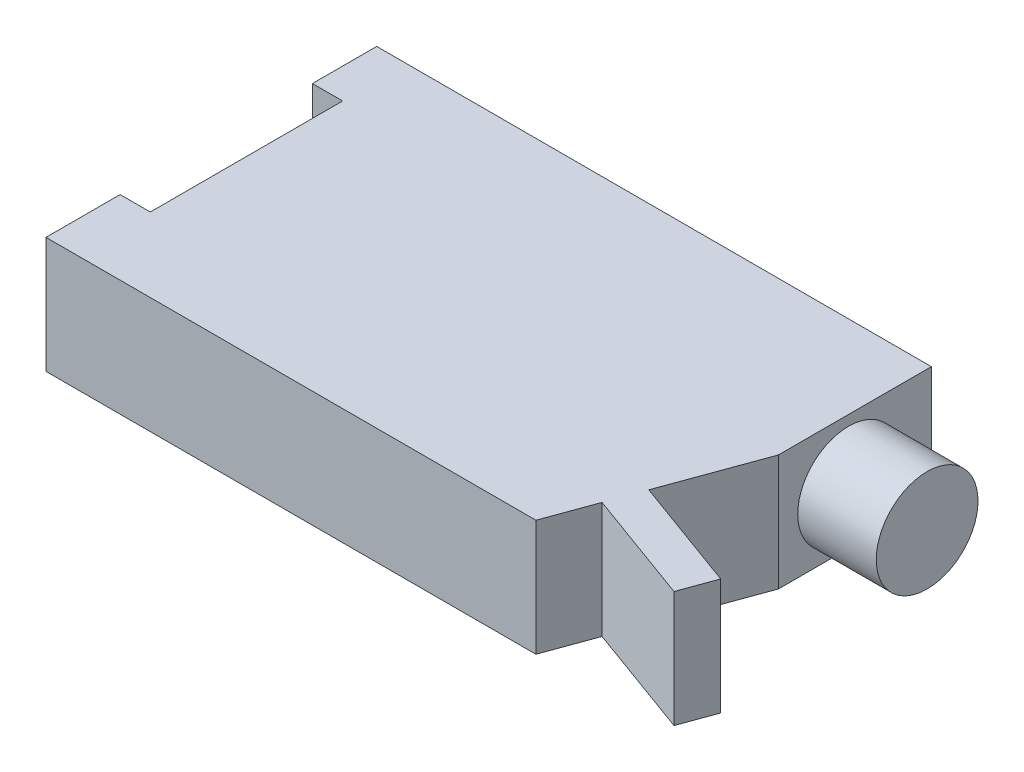
ISO-10303-21;
HEADER;
FILE_DESCRIPTION(('STEP AP214'),'2;1');
FILE_NAME('part.step','',(''),(''),'','','');
FILE_SCHEMA(('AUTOMOTIVE_DESIGN { 1 0 10303 214 1 1 1 1 }'));
ENDSEC;
DATA;
#1=APPLICATION_CONTEXT('core data for automotive mechanical design processes');
#2=APPLICATION_PROTOCOL_DEFINITION('international standard','automotive_design',2000,#1);
#3=PRODUCT_CONTEXT('',#1,'mechanical');
#4=PRODUCT('Part','Part','',(#3));
#5=PRODUCT_RELATED_PRODUCT_CATEGORY('part','',(#4));
#6=PRODUCT_DEFINITION_FORMATION('','',#4);
#7=PRODUCT_DEFINITION_CONTEXT('part definition',#1,'design');
#8=PRODUCT_DEFINITION('design','',#6,#7);
#9=PRODUCT_DEFINITION_SHAPE('','',#8);
#10=(LENGTH_UNIT() NAMED_UNIT(*) SI_UNIT(.MILLI.,.METRE.));
#11=(NAMED_UNIT(*) PLANE_ANGLE_UNIT() SI_UNIT($,.RADIAN.));
#12=(NAMED_UNIT(*) SI_UNIT($,.STERADIAN.) SOLID_ANGLE_UNIT());
#13=UNCERTAINTY_MEASURE_WITH_UNIT(LENGTH_MEASURE(1.E-05),#10,'distance_accuracy_value','');
#14=(GEOMETRIC_REPRESENTATION_CONTEXT(3) GLOBAL_UNCERTAINTY_ASSIGNED_CONTEXT((#13)) GLOBAL_UNIT_ASSIGNED_CONTEXT((#10,
#11,#12)) REPRESENTATION_CONTEXT('',''));
#15=CARTESIAN_POINT('',(0.,0.,0.));
#16=DIRECTION('',(0.,0.,1.));
#17=DIRECTION('',(1.,0.,0.));
#18=AXIS2_PLACEMENT_3D('',#15,#16,#17);
#19=CARTESIAN_POINT('',(-58.4731701475379,20.,-27.0754071661238));
#20=DIRECTION('',(1.,0.,0.));
#21=DIRECTION('',(0.,0.,-1.));
#22=AXIS2_PLACEMENT_3D('',#19,#20,#21);
#23=PLANE('',#22);
#24=DIRECTION('',(0.,0.,1.));
#25=VECTOR('',#24,1.);
#26=CARTESIAN_POINT('',(-58.4731701475379,20.,-27.0754071661238));
#27=LINE('',#26,#25);
#28=CARTESIAN_POINT('',(-58.4731701475379,20.,17.1273450932858));
#29=VERTEX_POINT('',#28);
#30=CARTESIAN_POINT('',(-58.4731701475379,20.,29.8884364820847));
#31=VERTEX_POINT('',#30);
#32=EDGE_CURVE('E101',#29,#31,#27,.T.);
#33=ORIENTED_EDGE('',*,*,#32,.F.);
#34=DIRECTION('',(0.,1.,0.));
#35=VECTOR('',#34,1.);
#36=CARTESIAN_POINT('',(-58.4731701475379,0.,17.1273450932858));
#37=LINE('',#36,#35);
#38=CARTESIAN_POINT('',(-58.4731701475379,0.,17.1273450932858));
#39=VERTEX_POINT('',#38);
#40=EDGE_CURVE('E195',#39,#29,#37,.T.);
#41=ORIENTED_EDGE('',*,*,#40,.F.);
#42=DIRECTION('',(0.,0.,1.));
#43=VECTOR('',#42,1.);
#44=CARTESIAN_POINT('',(-58.4731701475379,0.,-27.0754071661238));
#45=LINE('',#44,#43);
#46=CARTESIAN_POINT('',(-58.4731701475379,0.,29.8884364820847));
#47=VERTEX_POINT('',#46);
#48=EDGE_CURVE('E154',#39,#47,#45,.T.);
#49=ORIENTED_EDGE('',*,*,#48,.T.);
#50=DIRECTION('',(0.,-1.,0.));
#51=VECTOR('',#50,1.);
#52=CARTESIAN_POINT('',(-58.4731701475379,20.,29.8884364820847));
#53=LINE('',#52,#51);
#54=EDGE_CURVE('E41',#31,#47,#53,.T.);
#55=ORIENTED_EDGE('',*,*,#54,.F.);
#56=EDGE_LOOP('',(#33,#41,#49,#55));
#57=FACE_BOUND('',#56,.T.);
#58=ADVANCED_FACE('F33',(#57),#23,.F.);
#59=CARTESIAN_POINT('',(37.0629709905509,20.,-27.0754071661238));
#60=DIRECTION('',(-1.,0.,0.));
#61=DIRECTION('',(0.,0.,1.));
#62=AXIS2_PLACEMENT_3D('',#59,#60,#61);
#63=PLANE('',#62);
#64=DIRECTION('',(0.,0.,-1.));
#65=VECTOR('',#64,1.);
#66=CARTESIAN_POINT('',(37.0629709905509,0.,-27.0754071661238));
#67=LINE('',#66,#65);
#68=CARTESIAN_POINT('',(37.0629709905509,0.,-0.732918260648975));
#69=VERTEX_POINT('',#68);
#70=CARTESIAN_POINT('',(37.0629709905509,0.,-27.0754071661238));
#71=VERTEX_POINT('',#70);
#72=EDGE_CURVE('E165',#69,#71,#67,.T.);
#73=ORIENTED_EDGE('',*,*,#72,.T.);
#74=DIRECTION('',(0.,-1.,0.));
#75=VECTOR('',#74,1.);
#76=CARTESIAN_POINT('',(37.0629709905509,20.,-27.0754071661238));
#77=LINE('',#76,#75);
#78=CARTESIAN_POINT('',(37.0629709905509,20.,-27.0754071661238));
#79=VERTEX_POINT('',#78);
#80=EDGE_CURVE('E141',#79,#71,#77,.T.);
#81=ORIENTED_EDGE('',*,*,#80,.F.);
#82=DIRECTION('',(0.,0.,-1.));
#83=VECTOR('',#82,1.);
#84=CARTESIAN_POINT('',(37.0629709905509,20.,-27.0754071661238));
#85=LINE('',#84,#83);
#86=CARTESIAN_POINT('',(37.0629709905509,20.,-0.732918260648975));
#87=VERTEX_POINT('',#86);
#88=EDGE_CURVE('E125',#87,#79,#85,.T.);
#89=ORIENTED_EDGE('',*,*,#88,.F.);
#90=DIRECTION('',(0.,-1.,0.));
#91=VECTOR('',#90,1.);
#92=CARTESIAN_POINT('',(37.0629709905509,20.,-0.732918260648975));
#93=LINE('',#92,#91);
#94=EDGE_CURVE('E134',#87,#69,#93,.T.);
#95=ORIENTED_EDGE('',*,*,#94,.T.);
#96=EDGE_LOOP('',(#73,#81,#89,#95));
#97=FACE_BOUND('',#96,.T.);
#98=CARTESIAN_POINT('',(37.0629709905509,9.480390425324,-12.8217341776775));
#99=DIRECTION('',(-1.,0.,0.));
#100=DIRECTION('',(0.,0.,1.));
#101=AXIS2_PLACEMENT_3D('',#98,#99,#100);
#102=CIRCLE('',#101,8.76223869151352);
#103=CARTESIAN_POINT('',(37.0629709905509,9.480390425324,-4.05949548616399));
#104=VERTEX_POINT('',#103);
#105=EDGE_CURVE('E11',#104,#104,#102,.F.);
#106=ORIENTED_EDGE('',*,*,#105,.F.);
#107=EDGE_LOOP('',(#106));
#108=FACE_BOUND('',#107,.T.);
#109=ADVANCED_FACE('F143',(#97,#108),#63,.F.);
#110=CARTESIAN_POINT('',(-58.4731701475379,0.,-27.0754071661238));
#111=VERTEX_POINT('',#110);
#112=CARTESIAN_POINT('',(-58.4731701475379,0.,-16.0011107503237));
#113=VERTEX_POINT('',#112);
#114=EDGE_CURVE('E150',#111,#113,#45,.T.);
#115=ORIENTED_EDGE('',*,*,#114,.T.);
#116=DIRECTION('',(0.,1.,0.));
#117=VECTOR('',#116,1.);
#118=CARTESIAN_POINT('',(-58.4731701475379,0.,-16.0011107503237));
#119=LINE('',#118,#117);
#120=CARTESIAN_POINT('',(-58.4731701475379,20.,-16.0011107503237));
#121=VERTEX_POINT('',#120);
#122=EDGE_CURVE('E48',#113,#121,#119,.T.);
#123=ORIENTED_EDGE('',*,*,#122,.T.);
#124=CARTESIAN_POINT('',(-58.4731701475379,20.,-27.0754071661238));
#125=VERTEX_POINT('',#124);
#126=EDGE_CURVE('E220',#125,#121,#27,.T.);
#127=ORIENTED_EDGE('',*,*,#126,.F.);
#128=DIRECTION('',(0.,-1.,0.));
#129=VECTOR('',#128,1.);
#130=CARTESIAN_POINT('',(-58.4731701475379,20.,-27.0754071661238));
#131=LINE('',#130,#129);
#132=EDGE_CURVE('E146',#125,#111,#131,.T.);
#133=ORIENTED_EDGE('',*,*,#132,.T.);
#134=EDGE_LOOP('',(#115,#123,#127,#133));
#135=FACE_BOUND('',#134,.T.);
#136=ADVANCED_FACE('F35',(#135),#23,.F.);
#137=CARTESIAN_POINT('',(-58.4731701475379,20.,29.8884364820847));
#138=DIRECTION('',(0.,0.,-1.));
#139=DIRECTION('',(-1.,0.,0.));
#140=AXIS2_PLACEMENT_3D('',#137,#138,#139);
#141=PLANE('',#140);
#142=DIRECTION('',(1.,0.,0.));
#143=VECTOR('',#142,1.);
#144=CARTESIAN_POINT('',(-58.4731701475379,0.,29.8884364820847));
#145=LINE('',#144,#143);
#146=CARTESIAN_POINT('',(25.9177093312895,0.,29.8884364820847));
#147=VERTEX_POINT('',#146);
#148=EDGE_CURVE('E153',#47,#147,#145,.T.);
#149=ORIENTED_EDGE('',*,*,#148,.T.);
#150=DIRECTION('',(0.,-1.,0.));
#151=VECTOR('',#150,1.);
#152=CARTESIAN_POINT('',(25.9177093312895,20.,29.8884364820847));
#153=LINE('',#152,#151);
#154=CARTESIAN_POINT('',(25.9177093312895,20.,29.8884364820847));
#155=VERTEX_POINT('',#154);
#156=EDGE_CURVE('E180',#155,#147,#153,.T.);
#157=ORIENTED_EDGE('',*,*,#156,.F.);
#158=DIRECTION('',(1.,0.,0.));
#159=VECTOR('',#158,1.);
#160=CARTESIAN_POINT('',(-58.4731701475379,20.,29.8884364820847));
#161=LINE('',#160,#159);
#162=EDGE_CURVE('E188',#31,#155,#161,.T.);
#163=ORIENTED_EDGE('',*,*,#162,.F.);
#164=ORIENTED_EDGE('',*,*,#54,.T.);
#165=EDGE_LOOP('',(#149,#157,#163,#164));
#166=FACE_BOUND('',#165,.T.);
#167=ADVANCED_FACE('F185',(#166),#141,.F.);
#168=CARTESIAN_POINT('',(28.9562960020217,20.,21.5399882171923));
#169=DIRECTION('',(-0.939692620785907,0.,-0.342020143325672));
#170=DIRECTION('',(-0.342020143325672,0.,0.939692620785907));
#171=AXIS2_PLACEMENT_3D('',#168,#169,#170);
#172=PLANE('',#171);
#173=DIRECTION('',(0.342020143325672,0.,-0.939692620785907));
#174=VECTOR('',#173,1.);
#175=CARTESIAN_POINT('',(28.9562960020217,0.,21.5399882171923));
#176=LINE('',#175,#174);
#177=CARTESIAN_POINT('',(28.9562960020217,0.,21.5399882171923));
#178=VERTEX_POINT('',#177);
#179=EDGE_CURVE('E156',#147,#178,#176,.T.);
#180=ORIENTED_EDGE('',*,*,#179,.T.);
#181=DIRECTION('',(0.,-1.,0.));
#182=VECTOR('',#181,1.);
#183=CARTESIAN_POINT('',(28.9562960020217,20.,21.5399882171923));
#184=LINE('',#183,#182);
#185=CARTESIAN_POINT('',(28.9562960020217,20.,21.5399882171923));
#186=VERTEX_POINT('',#185);
#187=EDGE_CURVE('E177',#186,#178,#184,.T.);
#188=ORIENTED_EDGE('',*,*,#187,.F.);
#189=DIRECTION('',(0.342020143325672,0.,-0.939692620785907));
#190=VECTOR('',#189,1.);
#191=CARTESIAN_POINT('',(28.9562960020217,20.,21.5399882171923));
#192=LINE('',#191,#190);
#193=EDGE_CURVE('E214',#155,#186,#192,.T.);
#194=ORIENTED_EDGE('',*,*,#193,.F.);
#195=ORIENTED_EDGE('',*,*,#156,.T.);
#196=EDGE_LOOP('',(#180,#188,#194,#195));
#197=FACE_BOUND('',#196,.T.);
#198=ADVANCED_FACE('F205',(#197),#172,.F.);
#199=CARTESIAN_POINT('',(28.9562960020217,20.,21.5399882171923));
#200=DIRECTION('',(0.342020143325673,0.,-0.939692620785907));
#201=DIRECTION('',(-0.939692620785907,0.,-0.342020143325673));
#202=AXIS2_PLACEMENT_3D('',#199,#200,#201);
#203=PLANE('',#202);
#204=DIRECTION('',(0.939692620785907,0.,0.342020143325673));
#205=VECTOR('',#204,1.);
#206=CARTESIAN_POINT('',(28.9562960020217,0.,21.5399882171923));
#207=LINE('',#206,#205);
#208=CARTESIAN_POINT('',(48.4426126564886,0.,28.6324274549041));
#209=VERTEX_POINT('',#208);
#210=EDGE_CURVE('E158',#178,#209,#207,.T.);
#211=ORIENTED_EDGE('',*,*,#210,.T.);
#212=DIRECTION('',(0.,-1.,0.));
#213=VECTOR('',#212,1.);
#214=CARTESIAN_POINT('',(48.4426126564886,20.,28.6324274549041));
#215=LINE('',#214,#213);
#216=CARTESIAN_POINT('',(48.4426126564886,20.,28.6324274549041));
#217=VERTEX_POINT('',#216);
#218=EDGE_CURVE('E174',#217,#209,#215,.T.);
#219=ORIENTED_EDGE('',*,*,#218,.F.);
#220=DIRECTION('',(0.939692620785907,0.,0.342020143325673));
#221=VECTOR('',#220,1.);
#222=CARTESIAN_POINT('',(28.9562960020217,20.,21.5399882171923));
#223=LINE('',#222,#221);
#224=EDGE_CURVE('E211',#186,#217,#223,.T.);
#225=ORIENTED_EDGE('',*,*,#224,.F.);
#226=ORIENTED_EDGE('',*,*,#187,.T.);
#227=EDGE_LOOP('',(#211,#219,#225,#226));
#228=FACE_BOUND('',#227,.T.);
#229=ADVANCED_FACE('F209',(#228),#203,.F.);
#230=CARTESIAN_POINT('',(48.4426126564886,20.,28.6324274549041));
#231=DIRECTION('',(-0.939692620785907,0.,-0.342020143325673));
#232=DIRECTION('',(-0.342020143325673,0.,0.939692620785907));
#233=AXIS2_PLACEMENT_3D('',#230,#231,#232);
#234=PLANE('',#233);
#235=DIRECTION('',(0.342020143325673,0.,-0.939692620785907));
#236=VECTOR('',#235,1.);
#237=CARTESIAN_POINT('',(48.4426126564886,0.,28.6324274549041));
#238=LINE('',#237,#236);
#239=CARTESIAN_POINT('',(50.5911479925939,0.,22.7293751340544));
#240=VERTEX_POINT('',#239);
#241=EDGE_CURVE('E160',#209,#240,#238,.T.);
#242=ORIENTED_EDGE('',*,*,#241,.T.);
#243=DIRECTION('',(0.,-1.,0.));
#244=VECTOR('',#243,1.);
#245=CARTESIAN_POINT('',(50.5911479925939,20.,22.7293751340544));
#246=LINE('',#245,#244);
#247=CARTESIAN_POINT('',(50.5911479925939,20.,22.7293751340544));
#248=VERTEX_POINT('',#247);
#249=EDGE_CURVE('E171',#248,#240,#246,.T.);
#250=ORIENTED_EDGE('',*,*,#249,.F.);
#251=DIRECTION('',(0.342020143325673,0.,-0.939692620785907));
#252=VECTOR('',#251,1.);
#253=CARTESIAN_POINT('',(48.4426126564886,20.,28.6324274549041));
#254=LINE('',#253,#252);
#255=EDGE_CURVE('E213',#217,#248,#254,.T.);
#256=ORIENTED_EDGE('',*,*,#255,.F.);
#257=ORIENTED_EDGE('',*,*,#218,.T.);
#258=EDGE_LOOP('',(#242,#250,#256,#257));
#259=FACE_BOUND('',#258,.T.);
#260=ADVANCED_FACE('F296',(#259),#234,.F.);
#261=CARTESIAN_POINT('',(50.5911479925939,20.,22.7293751340544));
#262=DIRECTION('',(-0.342020143325672,0.,0.939692620785907));
#263=DIRECTION('',(0.939692620785907,0.,0.342020143325672));
#264=AXIS2_PLACEMENT_3D('',#261,#262,#263);
#265=PLANE('',#264);
#266=DIRECTION('',(-0.939692620785907,0.,-0.342020143325672));
#267=VECTOR('',#266,1.);
#268=CARTESIAN_POINT('',(50.5911479925939,0.,22.7293751340544));
#269=LINE('',#268,#267);
#270=CARTESIAN_POINT('',(31.1048313381271,0.,15.6369358963426));
#271=VERTEX_POINT('',#270);
#272=EDGE_CURVE('E162',#240,#271,#269,.T.);
#273=ORIENTED_EDGE('',*,*,#272,.T.);
#274=DIRECTION('',(0.,-1.,0.));
#275=VECTOR('',#274,1.);
#276=CARTESIAN_POINT('',(31.1048313381271,20.,15.6369358963426));
#277=LINE('',#276,#275);
#278=CARTESIAN_POINT('',(31.1048313381271,20.,15.6369358963426));
#279=VERTEX_POINT('',#278);
#280=EDGE_CURVE('E140',#279,#271,#277,.T.);
#281=ORIENTED_EDGE('',*,*,#280,.F.);
#282=DIRECTION('',(-0.939692620785907,0.,-0.342020143325672));
#283=VECTOR('',#282,1.);
#284=CARTESIAN_POINT('',(50.5911479925939,20.,22.7293751340544));
#285=LINE('',#284,#283);
#286=EDGE_CURVE('E128',#248,#279,#285,.T.);
#287=ORIENTED_EDGE('',*,*,#286,.F.);
#288=ORIENTED_EDGE('',*,*,#249,.T.);
#289=EDGE_LOOP('',(#273,#281,#287,#288));
#290=FACE_BOUND('',#289,.T.);
#291=ADVANCED_FACE('F277',(#290),#265,.F.);
#292=CARTESIAN_POINT('',(37.0629709905509,20.,-0.732918260648975));
#293=DIRECTION('',(-0.939692620785907,0.,-0.342020143325672));
#294=DIRECTION('',(-0.342020143325672,0.,0.939692620785907));
#295=AXIS2_PLACEMENT_3D('',#292,#293,#294);
#296=PLANE('',#295);
#297=DIRECTION('',(0.342020143325672,0.,-0.939692620785907));
#298=VECTOR('',#297,1.);
#299=CARTESIAN_POINT('',(37.0629709905509,0.,-0.732918260648975));
#300=LINE('',#299,#298);
#301=EDGE_CURVE('E137',#271,#69,#300,.T.);
#302=ORIENTED_EDGE('',*,*,#301,.T.);
#303=ORIENTED_EDGE('',*,*,#94,.F.);
#304=DIRECTION('',(0.342020143325672,0.,-0.939692620785907));
#305=VECTOR('',#304,1.);
#306=CARTESIAN_POINT('',(37.0629709905509,20.,-0.732918260648975));
#307=LINE('',#306,#305);
#308=EDGE_CURVE('E121',#279,#87,#307,.T.);
#309=ORIENTED_EDGE('',*,*,#308,.F.);
#310=ORIENTED_EDGE('',*,*,#280,.T.);
#311=EDGE_LOOP('',(#302,#303,#309,#310));
#312=FACE_BOUND('',#311,.T.);
#313=ADVANCED_FACE('F135',(#312),#296,.F.);
#314=CARTESIAN_POINT('',(-58.4731701475379,20.,-27.0754071661238));
#315=DIRECTION('',(0.,0.,1.));
#316=DIRECTION('',(1.,0.,0.));
#317=AXIS2_PLACEMENT_3D('',#314,#315,#316);
#318=PLANE('',#317);
#319=DIRECTION('',(-1.,0.,0.));
#320=VECTOR('',#319,1.);
#321=CARTESIAN_POINT('',(-58.4731701475379,0.,-27.0754071661238));
#322=LINE('',#321,#320);
#323=EDGE_CURVE('E93',#71,#111,#322,.T.);
#324=ORIENTED_EDGE('',*,*,#323,.T.);
#325=ORIENTED_EDGE('',*,*,#132,.F.);
#326=DIRECTION('',(-1.,0.,0.));
#327=VECTOR('',#326,1.);
#328=CARTESIAN_POINT('',(-58.4731701475379,20.,-27.0754071661238));
#329=LINE('',#328,#327);
#330=EDGE_CURVE('E57',#79,#125,#329,.T.);
#331=ORIENTED_EDGE('',*,*,#330,.F.);
#332=ORIENTED_EDGE('',*,*,#80,.T.);
#333=EDGE_LOOP('',(#324,#325,#331,#332));
#334=FACE_BOUND('',#333,.T.);
#335=ADVANCED_FACE('F269',(#334),#318,.F.);
#336=CARTESIAN_POINT('',(0.,20.,0.));
#337=DIRECTION('',(0.,1.,0.));
#338=DIRECTION('',(0.,0.,1.));
#339=AXIS2_PLACEMENT_3D('',#336,#337,#338);
#340=PLANE('',#339);
#341=DIRECTION('',(1.,0.,0.));
#342=VECTOR('',#341,1.);
#343=CARTESIAN_POINT('',(-53.2723482065478,20.,17.1273450932858));
#344=LINE('',#343,#342);
#345=CARTESIAN_POINT('',(-53.2723482065478,20.,17.1273450932858));
#346=VERTEX_POINT('',#345);
#347=EDGE_CURVE('E233',#29,#346,#344,.T.);
#348=ORIENTED_EDGE('',*,*,#347,.F.);
#349=ORIENTED_EDGE('',*,*,#32,.T.);
#350=ORIENTED_EDGE('',*,*,#162,.T.);
#351=ORIENTED_EDGE('',*,*,#193,.T.);
#352=ORIENTED_EDGE('',*,*,#224,.T.);
#353=ORIENTED_EDGE('',*,*,#255,.T.);
#354=ORIENTED_EDGE('',*,*,#286,.T.);
#355=ORIENTED_EDGE('',*,*,#308,.T.);
#356=ORIENTED_EDGE('',*,*,#88,.T.);
#357=ORIENTED_EDGE('',*,*,#330,.T.);
#358=ORIENTED_EDGE('',*,*,#126,.T.);
#359=DIRECTION('',(-1.,0.,0.));
#360=VECTOR('',#359,1.);
#361=CARTESIAN_POINT('',(-53.2723482065478,20.,-16.0011107503237));
#362=LINE('',#361,#360);
#363=CARTESIAN_POINT('',(-53.2723482065478,20.,-16.0011107503237));
#364=VERTEX_POINT('',#363);
#365=EDGE_CURVE('E237',#364,#121,#362,.T.);
#366=ORIENTED_EDGE('',*,*,#365,.F.);
#367=DIRECTION('',(0.,0.,-1.));
#368=VECTOR('',#367,1.);
#369=CARTESIAN_POINT('',(-53.2723482065478,20.,17.1273450932858));
#370=LINE('',#369,#368);
#371=EDGE_CURVE('E239',#346,#364,#370,.T.);
#372=ORIENTED_EDGE('',*,*,#371,.F.);
#373=EDGE_LOOP('',(#348,#349,#350,#351,#352,#353,#354,#355,#356,#357,#358,#366,#372));
#374=FACE_BOUND('',#373,.T.);
#375=ADVANCED_FACE('F123',(#374),#340,.T.);
#376=CARTESIAN_POINT('',(0.,0.,0.));
#377=DIRECTION('',(0.,1.,0.));
#378=DIRECTION('',(0.,0.,1.));
#379=AXIS2_PLACEMENT_3D('',#376,#377,#378);
#380=PLANE('',#379);
#381=ORIENTED_EDGE('',*,*,#48,.F.);
#382=DIRECTION('',(1.,0.,0.));
#383=VECTOR('',#382,1.);
#384=CARTESIAN_POINT('',(-53.2723482065478,0.,17.1273450932858));
#385=LINE('',#384,#383);
#386=CARTESIAN_POINT('',(-53.2723482065478,0.,17.1273450932858));
#387=VERTEX_POINT('',#386);
#388=EDGE_CURVE('E228',#39,#387,#385,.T.);
#389=ORIENTED_EDGE('',*,*,#388,.T.);
#390=DIRECTION('',(0.,0.,-1.));
#391=VECTOR('',#390,1.);
#392=CARTESIAN_POINT('',(-53.2723482065478,0.,17.1273450932858));
#393=LINE('',#392,#391);
#394=CARTESIAN_POINT('',(-53.2723482065478,0.,-16.0011107503237));
#395=VERTEX_POINT('',#394);
#396=EDGE_CURVE('E236',#387,#395,#393,.T.);
#397=ORIENTED_EDGE('',*,*,#396,.T.);
#398=DIRECTION('',(-1.,0.,0.));
#399=VECTOR('',#398,1.);
#400=CARTESIAN_POINT('',(-53.2723482065478,0.,-16.0011107503237));
#401=LINE('',#400,#399);
#402=EDGE_CURVE('E243',#395,#113,#401,.T.);
#403=ORIENTED_EDGE('',*,*,#402,.T.);
#404=ORIENTED_EDGE('',*,*,#114,.F.);
#405=ORIENTED_EDGE('',*,*,#323,.F.);
#406=ORIENTED_EDGE('',*,*,#72,.F.);
#407=ORIENTED_EDGE('',*,*,#301,.F.);
#408=ORIENTED_EDGE('',*,*,#272,.F.);
#409=ORIENTED_EDGE('',*,*,#241,.F.);
#410=ORIENTED_EDGE('',*,*,#210,.F.);
#411=ORIENTED_EDGE('',*,*,#179,.F.);
#412=ORIENTED_EDGE('',*,*,#148,.F.);
#413=EDGE_LOOP('',(#381,#389,#397,#403,#404,#405,#406,#407,#408,#409,#410,#411,#412));
#414=FACE_BOUND('',#413,.T.);
#415=ADVANCED_FACE('F200',(#414),#380,.F.);
#416=CARTESIAN_POINT('',(50.5911479925939,9.480390425324,-12.8217341776775));
#417=DIRECTION('',(-1.,0.,0.));
#418=DIRECTION('',(0.,0.,1.));
#419=AXIS2_PLACEMENT_3D('',#416,#417,#418);
#420=CYLINDRICAL_SURFACE('',#419,8.76223869151352);
#421=CARTESIAN_POINT('',(50.5911479925939,9.480390425324,-12.8217341776775));
#422=DIRECTION('',(1.,0.,0.));
#423=DIRECTION('',(0.,0.,-1.));
#424=AXIS2_PLACEMENT_3D('',#421,#422,#423);
#425=CIRCLE('',#424,8.76223869151352);
#426=CARTESIAN_POINT('',(50.5911479925939,9.480390425324,-21.583972869191));
#427=VERTEX_POINT('',#426);
#428=EDGE_CURVE('E198',#427,#427,#425,.T.);
#429=ORIENTED_EDGE('',*,*,#428,.F.);
#430=EDGE_LOOP('',(#429));
#431=FACE_BOUND('',#430,.T.);
#432=ORIENTED_EDGE('',*,*,#105,.T.);
#433=EDGE_LOOP('',(#432));
#434=FACE_BOUND('',#433,.T.);
#435=ADVANCED_FACE('F329',(#431,#434),#420,.T.);
#436=CARTESIAN_POINT('',(50.5911479925939,9.480390425324,-12.8217341776775));
#437=DIRECTION('',(1.,0.,0.));
#438=DIRECTION('',(0.,0.,-1.));
#439=AXIS2_PLACEMENT_3D('',#436,#437,#438);
#440=PLANE('',#439);
#441=ORIENTED_EDGE('',*,*,#428,.T.);
#442=EDGE_LOOP('',(#441));
#443=FACE_BOUND('',#442,.T.);
#444=ADVANCED_FACE('F333',(#443),#440,.T.);
#445=CARTESIAN_POINT('',(-53.2723482065478,0.,17.1273450932858));
#446=DIRECTION('',(1.,0.,0.));
#447=DIRECTION('',(0.,0.,-1.));
#448=AXIS2_PLACEMENT_3D('',#445,#446,#447);
#449=PLANE('',#448);
#450=ORIENTED_EDGE('',*,*,#371,.T.);
#451=DIRECTION('',(0.,1.,0.));
#452=VECTOR('',#451,1.);
#453=CARTESIAN_POINT('',(-53.2723482065478,0.,-16.0011107503237));
#454=LINE('',#453,#452);
#455=EDGE_CURVE('E225',#395,#364,#454,.T.);
#456=ORIENTED_EDGE('',*,*,#455,.F.);
#457=ORIENTED_EDGE('',*,*,#396,.F.);
#458=DIRECTION('',(0.,1.,0.));
#459=VECTOR('',#458,1.);
#460=CARTESIAN_POINT('',(-53.2723482065478,0.,17.1273450932858));
#461=LINE('',#460,#459);
#462=EDGE_CURVE('E224',#387,#346,#461,.T.);
#463=ORIENTED_EDGE('',*,*,#462,.T.);
#464=EDGE_LOOP('',(#450,#456,#457,#463));
#465=FACE_BOUND('',#464,.T.);
#466=ADVANCED_FACE('F253',(#465),#449,.F.);
#467=CARTESIAN_POINT('',(-53.2723482065478,0.,17.1273450932858));
#468=DIRECTION('',(0.,0.,1.));
#469=DIRECTION('',(1.,0.,0.));
#470=AXIS2_PLACEMENT_3D('',#467,#468,#469);
#471=PLANE('',#470);
#472=ORIENTED_EDGE('',*,*,#347,.T.);
#473=ORIENTED_EDGE('',*,*,#462,.F.);
#474=ORIENTED_EDGE('',*,*,#388,.F.);
#475=ORIENTED_EDGE('',*,*,#40,.T.);
#476=EDGE_LOOP('',(#472,#473,#474,#475));
#477=FACE_BOUND('',#476,.T.);
#478=ADVANCED_FACE('F262',(#477),#471,.F.);
#479=CARTESIAN_POINT('',(-53.2723482065478,0.,-16.0011107503237));
#480=DIRECTION('',(0.,0.,-1.));
#481=DIRECTION('',(-1.,0.,0.));
#482=AXIS2_PLACEMENT_3D('',#479,#480,#481);
#483=PLANE('',#482);
#484=ORIENTED_EDGE('',*,*,#365,.T.);
#485=ORIENTED_EDGE('',*,*,#122,.F.);
#486=ORIENTED_EDGE('',*,*,#402,.F.);
#487=ORIENTED_EDGE('',*,*,#455,.T.);
#488=EDGE_LOOP('',(#484,#485,#486,#487));
#489=FACE_BOUND('',#488,.T.);
#490=ADVANCED_FACE('F266',(#489),#483,.F.);
#491=CLOSED_SHELL('',(#58,#109,#136,#167,#198,#229,#260,#291,#313,#335,#375,#415,#435,#444,#466,
#478,#490));
#492=MANIFOLD_SOLID_BREP('B2',#491);
#493=ADVANCED_BREP_SHAPE_REPRESENTATION('',(#18,#492),#14);
#494=SHAPE_DEFINITION_REPRESENTATION(#9,#493);
ENDSEC;
END-ISO-10303-21;
